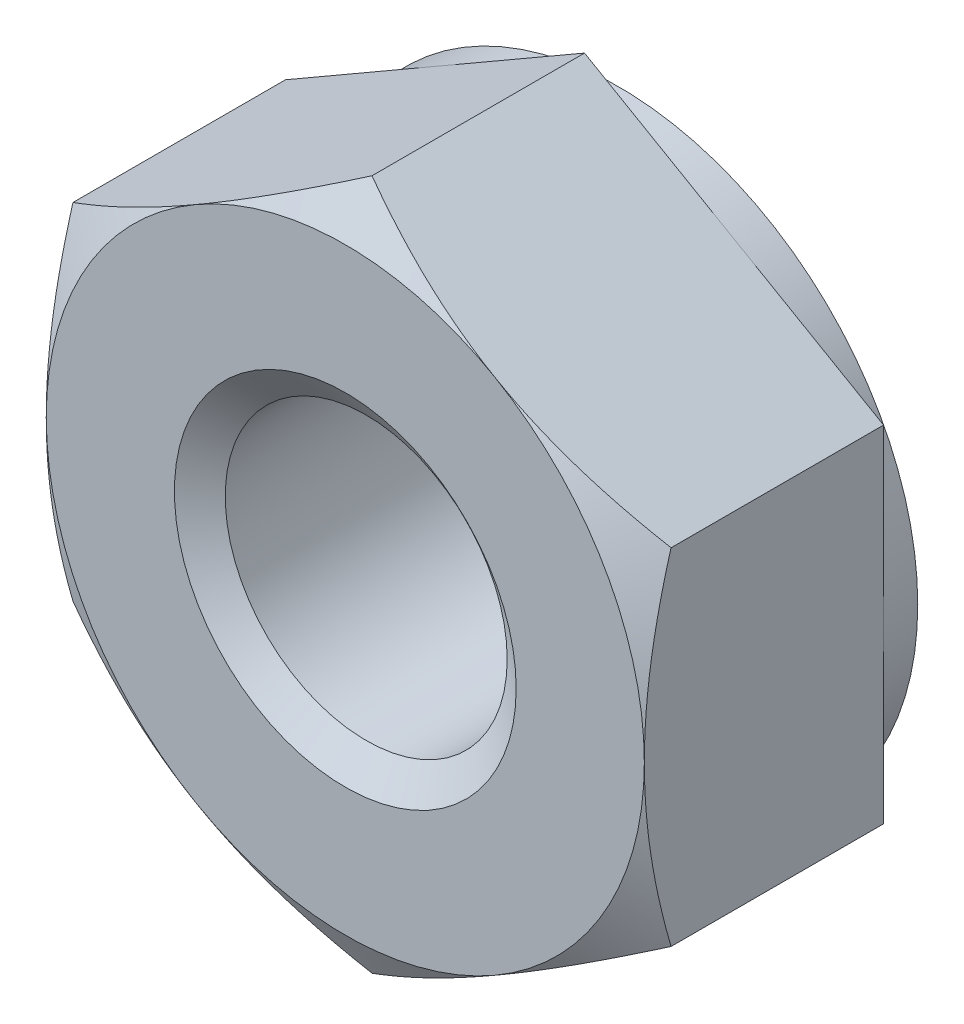
ISO-10303-21;
HEADER;
FILE_DESCRIPTION(('STEP AP214'),'2;1');
FILE_NAME('part.step','',(''),(''),'','','');
FILE_SCHEMA(('AUTOMOTIVE_DESIGN { 1 0 10303 214 1 1 1 1 }'));
ENDSEC;
DATA;
#1=APPLICATION_CONTEXT('core data for automotive mechanical design processes');
#2=APPLICATION_PROTOCOL_DEFINITION('international standard','automotive_design',2000,#1);
#3=PRODUCT_CONTEXT('',#1,'mechanical');
#4=PRODUCT('Part','Part','',(#3));
#5=PRODUCT_RELATED_PRODUCT_CATEGORY('part','',(#4));
#6=PRODUCT_DEFINITION_FORMATION('','',#4);
#7=PRODUCT_DEFINITION_CONTEXT('part definition',#1,'design');
#8=PRODUCT_DEFINITION('design','',#6,#7);
#9=PRODUCT_DEFINITION_SHAPE('','',#8);
#10=(LENGTH_UNIT() NAMED_UNIT(*) SI_UNIT(.MILLI.,.METRE.));
#11=(NAMED_UNIT(*) PLANE_ANGLE_UNIT() SI_UNIT($,.RADIAN.));
#12=(NAMED_UNIT(*) SI_UNIT($,.STERADIAN.) SOLID_ANGLE_UNIT());
#13=UNCERTAINTY_MEASURE_WITH_UNIT(LENGTH_MEASURE(1.E-05),#10,'distance_accuracy_value','');
#14=(GEOMETRIC_REPRESENTATION_CONTEXT(3) GLOBAL_UNCERTAINTY_ASSIGNED_CONTEXT((#13)) GLOBAL_UNIT_ASSIGNED_CONTEXT((#10,
#11,#12)) REPRESENTATION_CONTEXT('',''));
#15=CARTESIAN_POINT('',(0.,0.,0.));
#16=DIRECTION('',(0.,0.,1.));
#17=DIRECTION('',(1.,0.,0.));
#18=AXIS2_PLACEMENT_3D('',#15,#16,#17);
#19=CARTESIAN_POINT('',(0.,0.,-3.2));
#20=DIRECTION('',(0.,0.,1.));
#21=DIRECTION('',(1.,0.,0.));
#22=AXIS2_PLACEMENT_3D('',#19,#20,#21);
#23=CYLINDRICAL_SURFACE('',#22,1.65);
#24=CARTESIAN_POINT('',(0.,0.,-0.245072638373399));
#25=DIRECTION('',(0.,0.,1.));
#26=DIRECTION('',(1.,0.,0.));
#27=AXIS2_PLACEMENT_3D('',#24,#25,#26);
#28=CIRCLE('',#27,1.65);
#29=CARTESIAN_POINT('',(1.65,0.,-0.245072638373399));
#30=VERTEX_POINT('',#29);
#31=EDGE_CURVE('E157',#30,#30,#28,.F.);
#32=ORIENTED_EDGE('',*,*,#31,.F.);
#33=EDGE_LOOP('',(#32));
#34=FACE_BOUND('',#33,.T.);
#35=CARTESIAN_POINT('',(0.,0.,-2.9295273616266));
#36=DIRECTION('',(0.,0.,-1.));
#37=DIRECTION('',(-1.,0.,0.));
#38=AXIS2_PLACEMENT_3D('',#35,#36,#37);
#39=CIRCLE('',#38,1.65);
#40=CARTESIAN_POINT('',(-1.65,0.,-2.9295273616266));
#41=VERTEX_POINT('',#40);
#42=EDGE_CURVE('E45',#41,#41,#39,.F.);
#43=ORIENTED_EDGE('',*,*,#42,.F.);
#44=EDGE_LOOP('',(#43));
#45=FACE_BOUND('',#44,.T.);
#46=ADVANCED_FACE('F40',(#34,#45),#23,.F.);
#47=CARTESIAN_POINT('',(0.,4.04145188432738,-3.2));
#48=DIRECTION('',(-0.500000000000001,0.866025403784438,0.));
#49=DIRECTION('',(-0.866025403784438,-0.500000000000001,0.));
#50=AXIS2_PLACEMENT_3D('',#47,#48,#49);
#51=PLANE('',#50);
#52=DIRECTION('',(0.,0.,1.));
#53=VECTOR('',#52,1.);
#54=CARTESIAN_POINT('',(-3.5,2.02072594216369,-3.2));
#55=LINE('',#54,#53);
#56=CARTESIAN_POINT('',(-3.5,2.02072594216369,-2.8));
#57=VERTEX_POINT('',#56);
#58=CARTESIAN_POINT('',(-3.5,2.02072594216369,-0.312607391169646));
#59=VERTEX_POINT('',#58);
#60=EDGE_CURVE('E292',#57,#59,#55,.T.);
#61=ORIENTED_EDGE('',*,*,#60,.T.);
#62=CARTESIAN_POINT('',(-3.5002,2.02061047210985,-0.312674060693372));
#63=CARTESIAN_POINT('',(-3.34639282154755,2.10941108799267,-0.261385788989984));
#64=CARTESIAN_POINT('',(-3.19125798916558,2.19897822522909,-0.214740953816197));
#65=CARTESIAN_POINT('',(-2.87830199342322,2.37966345361545,-0.133321875533349));
#66=CARTESIAN_POINT('',(-2.7204752692125,2.47078475532382,-0.0985764355845612));
#67=CARTESIAN_POINT('',(-2.40677778961987,2.65189807961073,-0.0444900271828357));
#68=CARTESIAN_POINT('',(-2.25095530083931,2.74186223545399,-0.0247890862603812));
#69=CARTESIAN_POINT('',(-1.93857711279463,2.92221386641056,-0.00127013273725415));
#70=CARTESIAN_POINT('',(-1.78202254896577,3.01260068598001,0.00256735545443494));
#71=CARTESIAN_POINT('',(-1.48949078007901,3.1814939814933,-0.00541530187697763));
#72=CARTESIAN_POINT('',(-1.35346978754209,3.26002573814993,-0.0152754340696072));
#73=CARTESIAN_POINT('',(-1.08231397971101,3.41657761679354,-0.046526466899404));
#74=CARTESIAN_POINT('',(-0.947180102315317,3.49459719728458,-0.0679280432857989));
#75=CARTESIAN_POINT('',(-0.675465207594816,3.65147186489429,-0.121430407880578));
#76=CARTESIAN_POINT('',(-0.538918580721664,3.73030709667644,-0.153757994445088));
#77=CARTESIAN_POINT('',(-0.267861907055498,3.88680174018324,-0.227128933807996));
#78=CARTESIAN_POINT('',(-0.133348387531463,3.96446315689009,-0.268155046569869));
#79=CARTESIAN_POINT('',(0.000200000000000957,4.04156735438122,-0.312674060693374));
#80=B_SPLINE_CURVE_WITH_KNOTS('',3,(#62,#63,#64,#65,#66,#67,#68,#69,#70,#71,#72,#73,#74,#75,#76,
#77,#78,#79),.UNSPECIFIED.,.F.,.F.,(4,2,2,2,2,2,2,2,4),(0.,0.554793832886254,1.11092123814984,
1.65328467083219,2.19498204478403,2.6666513085086,3.13875761298267,3.6213361260051,
4.10296698719187),.UNSPECIFIED.);
#81=CARTESIAN_POINT('',(-1.75,3.03108891324553,0.));
#82=VERTEX_POINT('',#81);
#83=EDGE_CURVE('E64',#59,#82,#80,.T.);
#84=ORIENTED_EDGE('',*,*,#83,.T.);
#85=CARTESIAN_POINT('',(0.,4.04145188432738,-0.312607391169646));
#86=VERTEX_POINT('',#85);
#87=EDGE_CURVE('E171',#82,#86,#80,.T.);
#88=ORIENTED_EDGE('',*,*,#87,.T.);
#89=DIRECTION('',(0.,0.,1.));
#90=VECTOR('',#89,1.);
#91=CARTESIAN_POINT('',(0.,4.04145188432738,-3.2));
#92=LINE('',#91,#90);
#93=CARTESIAN_POINT('',(0.,4.04145188432738,-2.8));
#94=VERTEX_POINT('',#93);
#95=EDGE_CURVE('E280',#94,#86,#92,.T.);
#96=ORIENTED_EDGE('',*,*,#95,.F.);
#97=DIRECTION('',(-0.866025403784438,-0.500000000000001,0.));
#98=VECTOR('',#97,1.);
#99=CARTESIAN_POINT('',(0.,4.04145188432738,-2.8));
#100=LINE('',#99,#98);
#101=CARTESIAN_POINT('',(-1.75,3.03108891324553,-2.8));
#102=VERTEX_POINT('',#101);
#103=EDGE_CURVE('E268',#94,#102,#100,.T.);
#104=ORIENTED_EDGE('',*,*,#103,.T.);
#105=EDGE_CURVE('E264',#102,#57,#100,.T.);
#106=ORIENTED_EDGE('',*,*,#105,.T.);
#107=EDGE_LOOP('',(#61,#84,#88,#96,#104,#106));
#108=FACE_BOUND('',#107,.T.);
#109=ADVANCED_FACE('F42',(#108),#51,.T.);
#110=CARTESIAN_POINT('',(3.5,2.02072594216369,-3.2));
#111=DIRECTION('',(0.500000000000001,0.866025403784438,0.));
#112=DIRECTION('',(-0.866025403784438,0.500000000000001,0.));
#113=AXIS2_PLACEMENT_3D('',#110,#111,#112);
#114=PLANE('',#113);
#115=ORIENTED_EDGE('',*,*,#95,.T.);
#116=CARTESIAN_POINT('',(-0.000199999999999582,4.04156735438122,-0.312674060693374));
#117=CARTESIAN_POINT('',(0.15360717845245,3.9527667384984,-0.261385788989986));
#118=CARTESIAN_POINT('',(0.308742010834424,3.86319960126198,-0.214740953816199));
#119=CARTESIAN_POINT('',(0.621698006576782,3.68251437287562,-0.13332187553335));
#120=CARTESIAN_POINT('',(0.779524730787497,3.59139307116725,-0.0985764355845622));
#121=CARTESIAN_POINT('',(1.09322221038013,3.41027974688034,-0.0444900271828364));
#122=CARTESIAN_POINT('',(1.24904469916069,3.32031559103708,-0.0247890862603816));
#123=CARTESIAN_POINT('',(1.56142288720538,3.13996396008051,-0.00127013273725405));
#124=CARTESIAN_POINT('',(1.71797745103423,3.04957714051106,0.00256735545443515));
#125=CARTESIAN_POINT('',(2.01050921992099,2.88068384499777,-0.00541530187697721));
#126=CARTESIAN_POINT('',(2.14653021245791,2.80215208834114,-0.0152754340696066));
#127=CARTESIAN_POINT('',(2.417686020289,2.64560020969753,-0.0465264668994031));
#128=CARTESIAN_POINT('',(2.55281989768468,2.56758062920649,-0.0679280432857977));
#129=CARTESIAN_POINT('',(2.82453479240518,2.41070596159678,-0.121430407880577));
#130=CARTESIAN_POINT('',(2.96108141927834,2.33187072981463,-0.153757994445087));
#131=CARTESIAN_POINT('',(3.2321380929445,2.17537608630783,-0.227128933807994));
#132=CARTESIAN_POINT('',(3.36665161246854,2.09771466960098,-0.268155046569867));
#133=CARTESIAN_POINT('',(3.5002,2.02061047210985,-0.312674060693371));
#134=B_SPLINE_CURVE_WITH_KNOTS('',3,(#116,#117,#118,#119,#120,#121,#122,#123,#124,#125,#126,
#127,#128,#129,#130,#131,#132,#133),.UNSPECIFIED.,.F.,.F.,(4,2,2,2,2,2,2,2,4),(0.,
0.554793832886254,1.11092123814984,1.65328467083219,2.19498204478403,2.6666513085086,
3.13875761298267,3.6213361260051,4.10296698719187),.UNSPECIFIED.);
#135=CARTESIAN_POINT('',(1.75,3.03108891324553,0.));
#136=VERTEX_POINT('',#135);
#137=EDGE_CURVE('E168',#86,#136,#134,.T.);
#138=ORIENTED_EDGE('',*,*,#137,.T.);
#139=CARTESIAN_POINT('',(3.5,2.02072594216369,-0.312607391169646));
#140=VERTEX_POINT('',#139);
#141=EDGE_CURVE('E151',#136,#140,#134,.T.);
#142=ORIENTED_EDGE('',*,*,#141,.T.);
#143=DIRECTION('',(0.,0.,1.));
#144=VECTOR('',#143,1.);
#145=CARTESIAN_POINT('',(3.5,2.02072594216369,-3.2));
#146=LINE('',#145,#144);
#147=CARTESIAN_POINT('',(3.5,2.02072594216369,-2.8));
#148=VERTEX_POINT('',#147);
#149=EDGE_CURVE('E167',#148,#140,#146,.T.);
#150=ORIENTED_EDGE('',*,*,#149,.F.);
#151=DIRECTION('',(-0.866025403784438,0.500000000000001,0.));
#152=VECTOR('',#151,1.);
#153=CARTESIAN_POINT('',(3.5,2.02072594216369,-2.8));
#154=LINE('',#153,#152);
#155=CARTESIAN_POINT('',(1.75,3.03108891324553,-2.8));
#156=VERTEX_POINT('',#155);
#157=EDGE_CURVE('E276',#148,#156,#154,.T.);
#158=ORIENTED_EDGE('',*,*,#157,.T.);
#159=EDGE_CURVE('E272',#156,#94,#154,.T.);
#160=ORIENTED_EDGE('',*,*,#159,.T.);
#161=EDGE_LOOP('',(#115,#138,#142,#150,#158,#160));
#162=FACE_BOUND('',#161,.T.);
#163=ADVANCED_FACE('F240',(#162),#114,.T.);
#164=CARTESIAN_POINT('',(3.5,2.02072594216369,-3.2));
#165=DIRECTION('',(-1.,0.,0.));
#166=DIRECTION('',(0.,0.,1.));
#167=AXIS2_PLACEMENT_3D('',#164,#165,#166);
#168=PLANE('',#167);
#169=CARTESIAN_POINT('',(3.5,-5.35926299121406,-1.67484346858556));
#170=CARTESIAN_POINT('',(3.5,-5.20559319908842,-1.60058173692104));
#171=CARTESIAN_POINT('',(3.5,-5.05156008083376,-1.52705822833148));
#172=CARTESIAN_POINT('',(3.5,-4.7425707418071,-1.38190950344752));
#173=CARTESIAN_POINT('',(3.5,-4.58761436682437,-1.31028461582133));
#174=CARTESIAN_POINT('',(3.5,-4.27574500225542,-1.16897765517624));
#175=CARTESIAN_POINT('',(3.5,-4.11882589028192,-1.09930904568016));
#176=CARTESIAN_POINT('',(3.5,-3.80369792903856,-0.962964262242763));
#177=CARTESIAN_POINT('',(3.5,-3.64548914750596,-0.896287932319521));
#178=CARTESIAN_POINT('',(3.5,-3.32556618401855,-0.765931819095069));
#179=CARTESIAN_POINT('',(3.5,-3.16383281219924,-0.702298873688867));
#180=CARTESIAN_POINT('',(3.5,-2.83845840945598,-0.580016702089494));
#181=CARTESIAN_POINT('',(3.5,-2.67481716858826,-0.521368030370693));
#182=CARTESIAN_POINT('',(3.5,-2.34570278472049,-0.410630279877023));
#183=CARTESIAN_POINT('',(3.5,-2.18023438248743,-0.358527255435859));
#184=CARTESIAN_POINT('',(3.5,-1.8469452280637,-0.262572936976444));
#185=CARTESIAN_POINT('',(3.5,-1.6791252378753,-0.218719033467159));
#186=CARTESIAN_POINT('',(3.5,-1.34101828610925,-0.141391945584787));
#187=CARTESIAN_POINT('',(3.5,-1.17073068027693,-0.107921525211973));
#188=CARTESIAN_POINT('',(3.5,-0.828102385138485,-0.0536149564320507));
#189=CARTESIAN_POINT('',(3.5,-0.655761694017303,-0.0327788191952368));
#190=CARTESIAN_POINT('',(3.5,-0.31102049092445,-0.0055840865057568));
#191=CARTESIAN_POINT('',(3.5,-0.13862739720726,0.000866163165911258));
#192=CARTESIAN_POINT('',(3.5,0.206038074906535,-0.00105355807794609));
#193=CARTESIAN_POINT('',(3.5,0.378310473023179,-0.00941968196343193));
#194=CARTESIAN_POINT('',(3.5,0.672490555822326,-0.0357688927868922));
#195=CARTESIAN_POINT('',(3.5,0.794722791084091,-0.0503206340384215));
#196=CARTESIAN_POINT('',(3.5,1.0382430543056,-0.0859367340533558));
#197=CARTESIAN_POINT('',(3.5,1.15953093025886,-0.107002119926141));
#198=CARTESIAN_POINT('',(3.5,1.52187914771348,-0.178863187081452));
#199=CARTESIAN_POINT('',(3.5,1.76124104212632,-0.23830527562201));
#200=CARTESIAN_POINT('',(3.5,2.11940971387708,-0.340826814402554));
#201=CARTESIAN_POINT('',(3.5,2.24008344316346,-0.377749699085183));
#202=CARTESIAN_POINT('',(3.5,2.48017139213728,-0.455249007699293));
#203=CARTESIAN_POINT('',(3.5,2.59958641795613,-0.495822911663549));
#204=CARTESIAN_POINT('',(3.5,2.83665760451798,-0.579779986782752));
#205=CARTESIAN_POINT('',(3.5,2.95431988203483,-0.623146060034314));
#206=CARTESIAN_POINT('',(3.5,3.188731535088,-0.712423559566865));
#207=CARTESIAN_POINT('',(3.5,3.30548051959464,-0.758336014592949));
#208=CARTESIAN_POINT('',(3.5,3.42180736613348,-0.80527038072407));
#209=B_SPLINE_CURVE_WITH_KNOTS('',3,(#169,#170,#171,#172,#173,#174,#175,#176,#177,#178,#179,
#180,#181,#182,#183,#184,#185,#186,#187,#188,#189,#190,#191,#192,#193,#194,#195,#196,#197,#198,
#199,#200,#201,#202,#203,#204,#205,#206,#207,#208),.UNSPECIFIED.,.F.,.F.,(4,2,2,2,2,2,2,2,2,2,2,
2,2,2,2,2,2,2,2,4),(0.,0.512025318465737,1.02413870177436,1.53918270315241,2.05419982499223,
2.57553975872798,3.09693761309353,3.61720506610401,4.13730766217537,4.65754858684365,
5.17778997146961,5.69470725122282,6.21149033452401,6.58059623222331,6.94976036239485,
7.68863804939851,8.06719621660478,8.44549507476761,8.82166461280099,9.1979872473341),.UNSPECIFIED.);
#210=CARTESIAN_POINT('',(3.5,-2.0207259421637,-0.312607391169646));
#211=VERTEX_POINT('',#210);
#212=CARTESIAN_POINT('',(3.5,0.,0.));
#213=VERTEX_POINT('',#212);
#214=EDGE_CURVE('E132',#211,#213,#209,.T.);
#215=ORIENTED_EDGE('',*,*,#214,.F.);
#216=DIRECTION('',(0.,0.,1.));
#217=VECTOR('',#216,1.);
#218=CARTESIAN_POINT('',(3.5,-2.0207259421637,-3.2));
#219=LINE('',#218,#217);
#220=CARTESIAN_POINT('',(3.5,-2.0207259421637,-2.8));
#221=VERTEX_POINT('',#220);
#222=EDGE_CURVE('E285',#221,#211,#219,.T.);
#223=ORIENTED_EDGE('',*,*,#222,.F.);
#224=DIRECTION('',(0.,-1.,0.));
#225=VECTOR('',#224,1.);
#226=CARTESIAN_POINT('',(3.5,2.02072594216369,-2.8));
#227=LINE('',#226,#225);
#228=CARTESIAN_POINT('',(3.5,0.,-2.8));
#229=VERTEX_POINT('',#228);
#230=EDGE_CURVE('E277',#229,#221,#227,.T.);
#231=ORIENTED_EDGE('',*,*,#230,.F.);
#232=EDGE_CURVE('E279',#148,#229,#227,.T.);
#233=ORIENTED_EDGE('',*,*,#232,.F.);
#234=ORIENTED_EDGE('',*,*,#149,.T.);
#235=EDGE_CURVE('E145',#213,#140,#209,.T.);
#236=ORIENTED_EDGE('',*,*,#235,.F.);
#237=EDGE_LOOP('',(#215,#223,#231,#233,#234,#236));
#238=FACE_BOUND('',#237,.T.);
#239=ADVANCED_FACE('F164',(#238),#168,.F.);
#240=CARTESIAN_POINT('',(0.,-4.04145188432739,-3.2));
#241=DIRECTION('',(0.500000000000001,-0.866025403784438,0.));
#242=DIRECTION('',(0.866025403784438,0.500000000000001,0.));
#243=AXIS2_PLACEMENT_3D('',#240,#241,#242);
#244=PLANE('',#243);
#245=ORIENTED_EDGE('',*,*,#222,.T.);
#246=CARTESIAN_POINT('',(3.5002,-2.02061047210986,-0.312674060693374));
#247=CARTESIAN_POINT('',(3.34639282154755,-2.10941108799268,-0.261385788989986));
#248=CARTESIAN_POINT('',(3.19125798916558,-2.1989782252291,-0.214740953816199));
#249=CARTESIAN_POINT('',(2.87830199342322,-2.37966345361545,-0.133321875533351));
#250=CARTESIAN_POINT('',(2.7204752692125,-2.47078475532383,-0.0985764355845636));
#251=CARTESIAN_POINT('',(2.40677778961987,-2.65189807961074,-0.0444900271828383));
#252=CARTESIAN_POINT('',(2.25095530083931,-2.741862235454,-0.0247890862603838));
#253=CARTESIAN_POINT('',(1.93857711279462,-2.92221386641056,-0.00127013273725686));
#254=CARTESIAN_POINT('',(1.78202254896577,-3.01260068598002,0.00256735545443198));
#255=CARTESIAN_POINT('',(1.48949078007901,-3.18149398149331,-0.00541530187698112));
#256=CARTESIAN_POINT('',(1.35346978754209,-3.26002573814994,-0.0152754340696109));
#257=CARTESIAN_POINT('',(1.082313979711,-3.41657761679354,-0.0465264668994078));
#258=CARTESIAN_POINT('',(0.947180102315316,-3.49459719728458,-0.0679280432858026));
#259=CARTESIAN_POINT('',(0.675465207594815,-3.6514718648943,-0.121430407880582));
#260=CARTESIAN_POINT('',(0.538918580721663,-3.73030709667644,-0.153757994445092));
#261=CARTESIAN_POINT('',(0.267861907055497,-3.88680174018325,-0.227128933808));
#262=CARTESIAN_POINT('',(0.133348387531463,-3.9644631568901,-0.268155046569873));
#263=CARTESIAN_POINT('',(-0.000200000000000254,-4.04156735438123,-0.312674060693377));
#264=B_SPLINE_CURVE_WITH_KNOTS('',3,(#246,#247,#248,#249,#250,#251,#252,#253,#254,#255,#256,
#257,#258,#259,#260,#261,#262,#263),.UNSPECIFIED.,.F.,.F.,(4,2,2,2,2,2,2,2,4),(0.,
0.554793832886255,1.11092123814984,1.65328467083219,2.19498204478403,2.6666513085086,
3.13875761298268,3.6213361260051,4.10296698719187),.UNSPECIFIED.);
#265=CARTESIAN_POINT('',(1.75,-3.03108891324553,0.));
#266=VERTEX_POINT('',#265);
#267=EDGE_CURVE('E139',#211,#266,#264,.T.);
#268=ORIENTED_EDGE('',*,*,#267,.T.);
#269=CARTESIAN_POINT('',(0.,-4.04145188432738,-0.312607391169646));
#270=VERTEX_POINT('',#269);
#271=EDGE_CURVE('E178',#266,#270,#264,.T.);
#272=ORIENTED_EDGE('',*,*,#271,.T.);
#273=DIRECTION('',(0.,0.,1.));
#274=VECTOR('',#273,1.);
#275=CARTESIAN_POINT('',(0.,-4.04145188432739,-3.2));
#276=LINE('',#275,#274);
#277=CARTESIAN_POINT('',(0.,-4.04145188432739,-2.8));
#278=VERTEX_POINT('',#277);
#279=EDGE_CURVE('E287',#278,#270,#276,.T.);
#280=ORIENTED_EDGE('',*,*,#279,.F.);
#281=DIRECTION('',(0.866025403784438,0.500000000000001,0.));
#282=VECTOR('',#281,1.);
#283=CARTESIAN_POINT('',(0.,-4.04145188432739,-2.8));
#284=LINE('',#283,#282);
#285=CARTESIAN_POINT('',(1.75000000000001,-3.03108891324554,-2.8));
#286=VERTEX_POINT('',#285);
#287=EDGE_CURVE('E269',#278,#286,#284,.T.);
#288=ORIENTED_EDGE('',*,*,#287,.T.);
#289=EDGE_CURVE('E273',#286,#221,#284,.T.);
#290=ORIENTED_EDGE('',*,*,#289,.T.);
#291=EDGE_LOOP('',(#245,#268,#272,#280,#288,#290));
#292=FACE_BOUND('',#291,.T.);
#293=ADVANCED_FACE('F221',(#292),#244,.T.);
#294=CARTESIAN_POINT('',(-3.5,-2.02072594216369,-3.2));
#295=DIRECTION('',(-0.500000000000001,-0.866025403784438,0.));
#296=DIRECTION('',(0.866025403784438,-0.500000000000001,0.));
#297=AXIS2_PLACEMENT_3D('',#294,#295,#296);
#298=PLANE('',#297);
#299=ORIENTED_EDGE('',*,*,#279,.T.);
#300=CARTESIAN_POINT('',(0.000199999999999624,-4.04156735438123,-0.312674060693377));
#301=CARTESIAN_POINT('',(-0.15360717845245,-3.95276673849841,-0.261385788989989));
#302=CARTESIAN_POINT('',(-0.308742010834425,-3.86319960126199,-0.214740953816202));
#303=CARTESIAN_POINT('',(-0.621698006576783,-3.68251437287563,-0.133321875533353));
#304=CARTESIAN_POINT('',(-0.779524730787498,-3.59139307116726,-0.0985764355845654));
#305=CARTESIAN_POINT('',(-1.09322221038013,-3.41027974688034,-0.0444900271828395));
#306=CARTESIAN_POINT('',(-1.24904469916069,-3.32031559103708,-0.0247890862603848));
#307=CARTESIAN_POINT('',(-1.56142288720538,-3.13996396008052,-0.00127013273725731));
#308=CARTESIAN_POINT('',(-1.71797745103423,-3.04957714051106,0.00256735545443195));
#309=CARTESIAN_POINT('',(-2.01050921992099,-2.88068384499778,-0.0054153018769805));
#310=CARTESIAN_POINT('',(-2.14653021245791,-2.80215208834115,-0.01527543406961));
#311=CARTESIAN_POINT('',(-2.417686020289,-2.64560020969754,-0.0465264668994063));
#312=CARTESIAN_POINT('',(-2.55281989768469,-2.5675806292065,-0.0679280432858008));
#313=CARTESIAN_POINT('',(-2.82453479240519,-2.41070596159679,-0.121430407880579));
#314=CARTESIAN_POINT('',(-2.96108141927834,-2.33187072981464,-0.153757994445089));
#315=CARTESIAN_POINT('',(-3.2321380929445,-2.17537608630783,-0.227128933807996));
#316=CARTESIAN_POINT('',(-3.36665161246854,-2.09771466960099,-0.268155046569869));
#317=CARTESIAN_POINT('',(-3.5002,-2.02061047210986,-0.312674060693373));
#318=B_SPLINE_CURVE_WITH_KNOTS('',3,(#300,#301,#302,#303,#304,#305,#306,#307,#308,#309,#310,
#311,#312,#313,#314,#315,#316,#317),.UNSPECIFIED.,.F.,.F.,(4,2,2,2,2,2,2,2,4),(0.,
0.554793832886255,1.11092123814984,1.65328467083219,2.19498204478404,2.6666513085086,
3.13875761298268,3.6213361260051,4.10296698719187),.UNSPECIFIED.);
#319=CARTESIAN_POINT('',(-1.75,-3.03108891324553,0.));
#320=VERTEX_POINT('',#319);
#321=EDGE_CURVE('E215',#270,#320,#318,.T.);
#322=ORIENTED_EDGE('',*,*,#321,.T.);
#323=CARTESIAN_POINT('',(-3.5,-2.02072594216369,-0.312607391169646));
#324=VERTEX_POINT('',#323);
#325=EDGE_CURVE('E208',#320,#324,#318,.T.);
#326=ORIENTED_EDGE('',*,*,#325,.T.);
#327=DIRECTION('',(0.,0.,1.));
#328=VECTOR('',#327,1.);
#329=CARTESIAN_POINT('',(-3.5,-2.02072594216369,-3.2));
#330=LINE('',#329,#328);
#331=CARTESIAN_POINT('',(-3.5,-2.02072594216369,-2.8));
#332=VERTEX_POINT('',#331);
#333=EDGE_CURVE('E290',#332,#324,#330,.T.);
#334=ORIENTED_EDGE('',*,*,#333,.F.);
#335=DIRECTION('',(0.866025403784438,-0.500000000000001,0.));
#336=VECTOR('',#335,1.);
#337=CARTESIAN_POINT('',(-3.5,-2.02072594216369,-2.8));
#338=LINE('',#337,#336);
#339=CARTESIAN_POINT('',(-1.75000000000001,-3.03108891324554,-2.8));
#340=VERTEX_POINT('',#339);
#341=EDGE_CURVE('E259',#332,#340,#338,.T.);
#342=ORIENTED_EDGE('',*,*,#341,.T.);
#343=EDGE_CURVE('E265',#340,#278,#338,.T.);
#344=ORIENTED_EDGE('',*,*,#343,.T.);
#345=EDGE_LOOP('',(#299,#322,#326,#334,#342,#344));
#346=FACE_BOUND('',#345,.T.);
#347=ADVANCED_FACE('F217',(#346),#298,.T.);
#348=CARTESIAN_POINT('',(-3.5,2.02072594216369,-3.2));
#349=DIRECTION('',(-1.,0.,0.));
#350=DIRECTION('',(0.,0.,1.));
#351=AXIS2_PLACEMENT_3D('',#348,#349,#350);
#352=PLANE('',#351);
#353=ORIENTED_EDGE('',*,*,#333,.T.);
#354=CARTESIAN_POINT('',(-3.5,-5.35926299121406,-1.67484346858556));
#355=CARTESIAN_POINT('',(-3.5,-5.20559319908842,-1.60058173692104));
#356=CARTESIAN_POINT('',(-3.5,-5.05156008083375,-1.52705822833148));
#357=CARTESIAN_POINT('',(-3.5,-4.7425707418071,-1.38190950344752));
#358=CARTESIAN_POINT('',(-3.5,-4.58761436682437,-1.31028461582133));
#359=CARTESIAN_POINT('',(-3.5,-4.27574500225542,-1.16897765517624));
#360=CARTESIAN_POINT('',(-3.5,-4.11882589028192,-1.09930904568016));
#361=CARTESIAN_POINT('',(-3.5,-3.80369792903855,-0.962964262242763));
#362=CARTESIAN_POINT('',(-3.5,-3.64548914750595,-0.89628793231952));
#363=CARTESIAN_POINT('',(-3.5,-3.32556618401855,-0.765931819095068));
#364=CARTESIAN_POINT('',(-3.5,-3.16383281219924,-0.702298873688866));
#365=CARTESIAN_POINT('',(-3.5,-2.83845840945597,-0.580016702089493));
#366=CARTESIAN_POINT('',(-3.5,-2.67481716858826,-0.521368030370692));
#367=CARTESIAN_POINT('',(-3.5,-2.34570278472049,-0.410630279877022));
#368=CARTESIAN_POINT('',(-3.5,-2.18023438248742,-0.358527255435858));
#369=CARTESIAN_POINT('',(-3.5,-1.8469452280637,-0.262572936976443));
#370=CARTESIAN_POINT('',(-3.5,-1.6791252378753,-0.218719033467158));
#371=CARTESIAN_POINT('',(-3.5,-1.34101828610925,-0.141391945584787));
#372=CARTESIAN_POINT('',(-3.5,-1.17073068027693,-0.107921525211973));
#373=CARTESIAN_POINT('',(-3.5,-0.828102385138484,-0.0536149564320504));
#374=CARTESIAN_POINT('',(-3.5,-0.655761694017301,-0.0327788191952365));
#375=CARTESIAN_POINT('',(-3.5,-0.311020490924449,-0.00558408650575661));
#376=CARTESIAN_POINT('',(-3.5,-0.138627397207259,0.00086616316591139));
#377=CARTESIAN_POINT('',(-3.5,0.206038074906536,-0.00105355807794622));
#378=CARTESIAN_POINT('',(-3.5,0.37831047302318,-0.00941968196343225));
#379=CARTESIAN_POINT('',(-3.5,0.672490555822327,-0.0357688927868924));
#380=CARTESIAN_POINT('',(-3.5,0.794722791084092,-0.0503206340384215));
#381=CARTESIAN_POINT('',(-3.5,1.0382430543056,-0.0859367340533558));
#382=CARTESIAN_POINT('',(-3.5,1.15953093025887,-0.107002119926141));
#383=CARTESIAN_POINT('',(-3.5,1.52187914771348,-0.178863187081453));
#384=CARTESIAN_POINT('',(-3.5,1.76124104212632,-0.23830527562201));
#385=CARTESIAN_POINT('',(-3.5,2.11940971387708,-0.340826814402554));
#386=CARTESIAN_POINT('',(-3.5,2.24008344316346,-0.377749699085183));
#387=CARTESIAN_POINT('',(-3.5,2.48017139213728,-0.455249007699293));
#388=CARTESIAN_POINT('',(-3.5,2.59958641795613,-0.49582291166355));
#389=CARTESIAN_POINT('',(-3.5,2.83665760451798,-0.579779986782752));
#390=CARTESIAN_POINT('',(-3.5,2.95431988203483,-0.623146060034314));
#391=CARTESIAN_POINT('',(-3.5,3.188731535088,-0.712423559566866));
#392=CARTESIAN_POINT('',(-3.5,3.30548051959464,-0.75833601459295));
#393=CARTESIAN_POINT('',(-3.5,3.42180736613349,-0.805270380724071));
#394=B_SPLINE_CURVE_WITH_KNOTS('',3,(#354,#355,#356,#357,#358,#359,#360,#361,#362,#363,#364,
#365,#366,#367,#368,#369,#370,#371,#372,#373,#374,#375,#376,#377,#378,#379,#380,#381,#382,#383,
#384,#385,#386,#387,#388,#389,#390,#391,#392,#393),.UNSPECIFIED.,.F.,.F.,(4,2,2,2,2,2,2,2,2,2,2,
2,2,2,2,2,2,2,2,4),(0.,0.512025318465737,1.02413870177436,1.53918270315241,2.05419982499223,
2.57553975872798,3.09693761309353,3.61720506610401,4.13730766217537,4.65754858684365,
5.17778997146961,5.69470725122282,6.21149033452401,6.58059623222331,6.94976036239485,
7.68863804939851,8.06719621660478,8.4454950747676,8.82166461280099,9.1979872473341),.UNSPECIFIED.);
#395=CARTESIAN_POINT('',(-3.5,0.,0.));
#396=VERTEX_POINT('',#395);
#397=EDGE_CURVE('E216',#324,#396,#394,.T.);
#398=ORIENTED_EDGE('',*,*,#397,.T.);
#399=EDGE_CURVE('E156',#396,#59,#394,.T.);
#400=ORIENTED_EDGE('',*,*,#399,.T.);
#401=ORIENTED_EDGE('',*,*,#60,.F.);
#402=DIRECTION('',(0.,-1.,0.));
#403=VECTOR('',#402,1.);
#404=CARTESIAN_POINT('',(-3.5,2.02072594216369,-2.8));
#405=LINE('',#404,#403);
#406=CARTESIAN_POINT('',(-3.5,0.,-2.8));
#407=VERTEX_POINT('',#406);
#408=EDGE_CURVE('E299',#57,#407,#405,.T.);
#409=ORIENTED_EDGE('',*,*,#408,.T.);
#410=EDGE_CURVE('E297',#407,#332,#405,.T.);
#411=ORIENTED_EDGE('',*,*,#410,.T.);
#412=EDGE_LOOP('',(#353,#398,#400,#401,#409,#411));
#413=FACE_BOUND('',#412,.T.);
#414=ADVANCED_FACE('F220',(#413),#352,.T.);
#415=CARTESIAN_POINT('',(0.,4.04145188432738,0.));
#416=DIRECTION('',(0.,0.,-1.));
#417=DIRECTION('',(-1.,0.,0.));
#418=AXIS2_PLACEMENT_3D('',#415,#416,#417);
#419=PLANE('',#418);
#420=CARTESIAN_POINT('',(0.,0.,0.));
#421=DIRECTION('',(0.,0.,1.));
#422=DIRECTION('',(1.,0.,0.));
#423=AXIS2_PLACEMENT_3D('',#420,#421,#422);
#424=CIRCLE('',#423,2.);
#425=CARTESIAN_POINT('',(2.,0.,0.));
#426=VERTEX_POINT('',#425);
#427=EDGE_CURVE('E302',#426,#426,#424,.T.);
#428=ORIENTED_EDGE('',*,*,#427,.F.);
#429=EDGE_LOOP('',(#428));
#430=FACE_BOUND('',#429,.T.);
#431=CARTESIAN_POINT('',(0.,0.,0.));
#432=DIRECTION('',(0.,0.,-1.));
#433=DIRECTION('',(-1.,0.,0.));
#434=AXIS2_PLACEMENT_3D('',#431,#432,#433);
#435=CIRCLE('',#434,3.5);
#436=EDGE_CURVE('E52',#82,#396,#435,.F.);
#437=ORIENTED_EDGE('',*,*,#436,.T.);
#438=EDGE_CURVE('E12',#396,#320,#435,.F.);
#439=ORIENTED_EDGE('',*,*,#438,.T.);
#440=EDGE_CURVE('E50',#320,#266,#435,.F.);
#441=ORIENTED_EDGE('',*,*,#440,.T.);
#442=EDGE_CURVE('E136',#266,#213,#435,.F.);
#443=ORIENTED_EDGE('',*,*,#442,.T.);
#444=CARTESIAN_POINT('',(0.,0.,0.));
#445=DIRECTION('',(0.,0.,1.));
#446=DIRECTION('',(1.,0.,0.));
#447=AXIS2_PLACEMENT_3D('',#444,#445,#446);
#448=CIRCLE('',#447,3.5);
#449=EDGE_CURVE('E148',#213,#136,#448,.T.);
#450=ORIENTED_EDGE('',*,*,#449,.T.);
#451=EDGE_CURVE('E162',#136,#82,#435,.F.);
#452=ORIENTED_EDGE('',*,*,#451,.T.);
#453=EDGE_LOOP('',(#437,#439,#441,#443,#450,#452));
#454=FACE_BOUND('',#453,.T.);
#455=ADVANCED_FACE('F160',(#430,#454),#419,.F.);
#456=CARTESIAN_POINT('',(0.,4.04145188432738,-3.2));
#457=DIRECTION('',(0.,0.,-1.));
#458=DIRECTION('',(-1.,0.,0.));
#459=AXIS2_PLACEMENT_3D('',#456,#457,#458);
#460=PLANE('',#459);
#461=CARTESIAN_POINT('',(0.,0.,-3.2));
#462=DIRECTION('',(0.,0.,-1.));
#463=DIRECTION('',(-1.,0.,0.));
#464=AXIS2_PLACEMENT_3D('',#461,#462,#463);
#465=CIRCLE('',#464,2.);
#466=CARTESIAN_POINT('',(-2.,0.,-3.2));
#467=VERTEX_POINT('',#466);
#468=EDGE_CURVE('E303',#467,#467,#465,.F.);
#469=ORIENTED_EDGE('',*,*,#468,.T.);
#470=EDGE_LOOP('',(#469));
#471=FACE_BOUND('',#470,.T.);
#472=CARTESIAN_POINT('',(0.,0.,-3.2));
#473=DIRECTION('',(0.,0.,-1.));
#474=DIRECTION('',(-1.,0.,0.));
#475=AXIS2_PLACEMENT_3D('',#472,#473,#474);
#476=CIRCLE('',#475,3.5);
#477=CARTESIAN_POINT('',(-3.5,0.,-3.2));
#478=VERTEX_POINT('',#477);
#479=EDGE_CURVE('E283',#478,#478,#476,.F.);
#480=ORIENTED_EDGE('',*,*,#479,.F.);
#481=EDGE_LOOP('',(#480));
#482=FACE_BOUND('',#481,.T.);
#483=ADVANCED_FACE('F230',(#471,#482),#460,.T.);
#484=CARTESIAN_POINT('',(0.,14.0414518843274,-2.8));
#485=DIRECTION('',(0.,0.,-1.));
#486=DIRECTION('',(-1.,0.,0.));
#487=AXIS2_PLACEMENT_3D('',#484,#485,#486);
#488=PLANE('',#487);
#489=ORIENTED_EDGE('',*,*,#232,.T.);
#490=CARTESIAN_POINT('',(0.,0.,-2.8));
#491=DIRECTION('',(0.,0.,1.));
#492=DIRECTION('',(1.,0.,0.));
#493=AXIS2_PLACEMENT_3D('',#490,#491,#492);
#494=CIRCLE('',#493,3.5);
#495=EDGE_CURVE('E256',#229,#156,#494,.T.);
#496=ORIENTED_EDGE('',*,*,#495,.T.);
#497=ORIENTED_EDGE('',*,*,#157,.F.);
#498=EDGE_LOOP('',(#489,#496,#497));
#499=FACE_BOUND('',#498,.T.);
#500=ADVANCED_FACE('F247',(#499),#488,.T.);
#501=ORIENTED_EDGE('',*,*,#230,.T.);
#502=ORIENTED_EDGE('',*,*,#289,.F.);
#503=EDGE_CURVE('E261',#286,#229,#494,.T.);
#504=ORIENTED_EDGE('',*,*,#503,.T.);
#505=EDGE_LOOP('',(#501,#502,#504));
#506=FACE_BOUND('',#505,.T.);
#507=ADVANCED_FACE('F449',(#506),#488,.T.);
#508=EDGE_CURVE('E260',#156,#102,#494,.T.);
#509=ORIENTED_EDGE('',*,*,#508,.T.);
#510=ORIENTED_EDGE('',*,*,#103,.F.);
#511=ORIENTED_EDGE('',*,*,#159,.F.);
#512=EDGE_LOOP('',(#509,#510,#511));
#513=FACE_BOUND('',#512,.T.);
#514=ADVANCED_FACE('F440',(#513),#488,.T.);
#515=ORIENTED_EDGE('',*,*,#343,.F.);
#516=EDGE_CURVE('E513',#340,#286,#494,.T.);
#517=ORIENTED_EDGE('',*,*,#516,.T.);
#518=ORIENTED_EDGE('',*,*,#287,.F.);
#519=EDGE_LOOP('',(#515,#517,#518));
#520=FACE_BOUND('',#519,.T.);
#521=ADVANCED_FACE('F431',(#520),#488,.T.);
#522=EDGE_CURVE('E527',#102,#407,#494,.T.);
#523=ORIENTED_EDGE('',*,*,#522,.T.);
#524=ORIENTED_EDGE('',*,*,#408,.F.);
#525=ORIENTED_EDGE('',*,*,#105,.F.);
#526=EDGE_LOOP('',(#523,#524,#525));
#527=FACE_BOUND('',#526,.T.);
#528=ADVANCED_FACE('F415',(#527),#488,.T.);
#529=CARTESIAN_POINT('',(0.,0.,0.));
#530=DIRECTION('',(0.,0.,1.));
#531=DIRECTION('',(1.,0.,0.));
#532=AXIS2_PLACEMENT_3D('',#529,#530,#531);
#533=CYLINDRICAL_SURFACE('',#532,3.5);
#534=ORIENTED_EDGE('',*,*,#479,.T.);
#535=EDGE_LOOP('',(#534));
#536=FACE_BOUND('',#535,.T.);
#537=ORIENTED_EDGE('',*,*,#508,.F.);
#538=ORIENTED_EDGE('',*,*,#495,.F.);
#539=ORIENTED_EDGE('',*,*,#503,.F.);
#540=ORIENTED_EDGE('',*,*,#516,.F.);
#541=EDGE_CURVE('E529',#407,#340,#494,.T.);
#542=ORIENTED_EDGE('',*,*,#541,.F.);
#543=ORIENTED_EDGE('',*,*,#522,.F.);
#544=EDGE_LOOP('',(#537,#538,#539,#540,#542,#543));
#545=FACE_BOUND('',#544,.T.);
#546=ADVANCED_FACE('F245',(#536,#545),#533,.T.);
#547=ORIENTED_EDGE('',*,*,#410,.F.);
#548=ORIENTED_EDGE('',*,*,#541,.T.);
#549=ORIENTED_EDGE('',*,*,#341,.F.);
#550=EDGE_LOOP('',(#547,#548,#549));
#551=FACE_BOUND('',#550,.T.);
#552=ADVANCED_FACE('F198',(#551),#488,.T.);
#553=CARTESIAN_POINT('',(0.,0.,0.));
#554=DIRECTION('',(0.,0.,-1.));
#555=DIRECTION('',(-1.,0.,0.));
#556=AXIS2_PLACEMENT_3D('',#553,#554,#555);
#557=CONICAL_SURFACE('',#556,3.5,1.0471975511966);
#558=ORIENTED_EDGE('',*,*,#399,.F.);
#559=ORIENTED_EDGE('',*,*,#436,.F.);
#560=ORIENTED_EDGE('',*,*,#83,.F.);
#561=EDGE_LOOP('',(#558,#559,#560));
#562=FACE_BOUND('',#561,.T.);
#563=ADVANCED_FACE('F377',(#562),#557,.T.);
#564=ORIENTED_EDGE('',*,*,#451,.F.);
#565=ORIENTED_EDGE('',*,*,#137,.F.);
#566=ORIENTED_EDGE('',*,*,#87,.F.);
#567=EDGE_LOOP('',(#564,#565,#566));
#568=FACE_BOUND('',#567,.T.);
#569=ADVANCED_FACE('F196',(#568),#557,.T.);
#570=ORIENTED_EDGE('',*,*,#449,.F.);
#571=ORIENTED_EDGE('',*,*,#235,.T.);
#572=ORIENTED_EDGE('',*,*,#141,.F.);
#573=EDGE_LOOP('',(#570,#571,#572));
#574=FACE_BOUND('',#573,.T.);
#575=ADVANCED_FACE('F149',(#574),#557,.T.);
#576=ORIENTED_EDGE('',*,*,#214,.T.);
#577=ORIENTED_EDGE('',*,*,#442,.F.);
#578=ORIENTED_EDGE('',*,*,#267,.F.);
#579=EDGE_LOOP('',(#576,#577,#578));
#580=FACE_BOUND('',#579,.T.);
#581=ADVANCED_FACE('F134',(#580),#557,.T.);
#582=ORIENTED_EDGE('',*,*,#440,.F.);
#583=ORIENTED_EDGE('',*,*,#321,.F.);
#584=ORIENTED_EDGE('',*,*,#271,.F.);
#585=EDGE_LOOP('',(#582,#583,#584));
#586=FACE_BOUND('',#585,.T.);
#587=ADVANCED_FACE('F195',(#586),#557,.T.);
#588=ORIENTED_EDGE('',*,*,#438,.F.);
#589=ORIENTED_EDGE('',*,*,#397,.F.);
#590=ORIENTED_EDGE('',*,*,#325,.F.);
#591=EDGE_LOOP('',(#588,#589,#590));
#592=FACE_BOUND('',#591,.T.);
#593=ADVANCED_FACE('F189',(#592),#557,.T.);
#594=CARTESIAN_POINT('',(0.,0.,-0.269579902210739));
#595=DIRECTION('',(0.,0.,1.));
#596=DIRECTION('',(1.,0.,0.));
#597=AXIS2_PLACEMENT_3D('',#594,#595,#596);
#598=CONICAL_SURFACE('',#597,1.615,0.95993108859688);
#599=ORIENTED_EDGE('',*,*,#427,.T.);
#600=EDGE_LOOP('',(#599));
#601=FACE_BOUND('',#600,.T.);
#602=ORIENTED_EDGE('',*,*,#31,.T.);
#603=EDGE_LOOP('',(#602));
#604=FACE_BOUND('',#603,.T.);
#605=ADVANCED_FACE('F194',(#601,#604),#598,.F.);
#606=CARTESIAN_POINT('',(0.,0.,-3.1746));
#607=DIRECTION('',(0.,0.,-1.));
#608=DIRECTION('',(-1.,0.,0.));
#609=AXIS2_PLACEMENT_3D('',#606,#607,#608);
#610=CONICAL_SURFACE('',#609,2.,0.95993108859688);
#611=CARTESIAN_POINT('',(0.,0.,-3.1746));
#612=DIRECTION('',(0.,0.,1.));
#613=DIRECTION('',(1.,0.,0.));
#614=AXIS2_PLACEMENT_3D('',#611,#612,#613);
#615=CIRCLE('',#614,2.);
#616=CARTESIAN_POINT('',(2.,0.,-3.1746));
#617=VERTEX_POINT('',#616);
#618=EDGE_CURVE('E305',#617,#617,#615,.T.);
#619=ORIENTED_EDGE('',*,*,#618,.F.);
#620=EDGE_LOOP('',(#619));
#621=FACE_BOUND('',#620,.T.);
#622=ORIENTED_EDGE('',*,*,#42,.T.);
#623=EDGE_LOOP('',(#622));
#624=FACE_BOUND('',#623,.T.);
#625=ADVANCED_FACE('F318',(#621,#624),#610,.F.);
#626=CARTESIAN_POINT('',(0.,0.,-25.0375057290932));
#627=DIRECTION('',(0.,0.,1.));
#628=DIRECTION('',(1.,0.,0.));
#629=AXIS2_PLACEMENT_3D('',#626,#627,#628);
#630=CYLINDRICAL_SURFACE('',#629,2.);
#631=ORIENTED_EDGE('',*,*,#468,.F.);
#632=EDGE_LOOP('',(#631));
#633=FACE_BOUND('',#632,.T.);
#634=ORIENTED_EDGE('',*,*,#618,.T.);
#635=EDGE_LOOP('',(#634));
#636=FACE_BOUND('',#635,.T.);
#637=ADVANCED_FACE('F322',(#633,#636),#630,.F.);
#638=CLOSED_SHELL('',(#46,#109,#163,#239,#293,#347,#414,#455,#483,#500,#507,#514,#521,#528,#546,
#552,#563,#569,#575,#581,#587,#593,#605,#625,#637));
#639=MANIFOLD_SOLID_BREP('B2',#638);
#640=ADVANCED_BREP_SHAPE_REPRESENTATION('',(#18,#639),#14);
#641=SHAPE_DEFINITION_REPRESENTATION(#9,#640);
ENDSEC;
END-ISO-10303-21;
